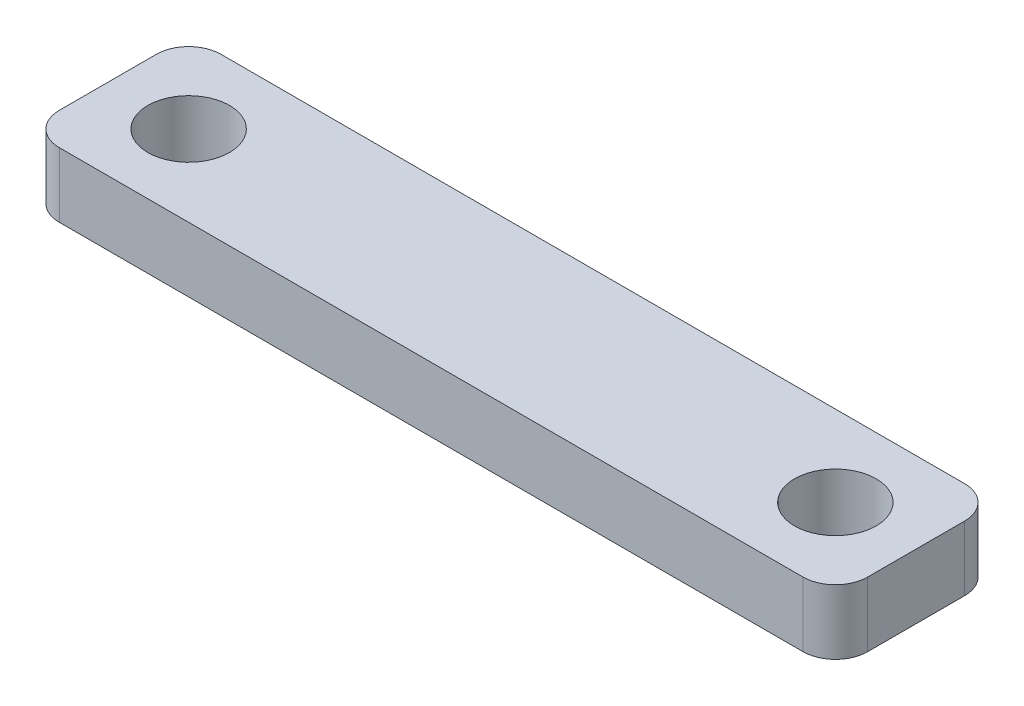
ISO-10303-21;
HEADER;
FILE_DESCRIPTION(('STEP AP214'),'2;1');
FILE_NAME('part.step','',(''),(''),'','','');
FILE_SCHEMA(('AUTOMOTIVE_DESIGN { 1 0 10303 214 1 1 1 1 }'));
ENDSEC;
DATA;
#1=APPLICATION_CONTEXT('core data for automotive mechanical design processes');
#2=APPLICATION_PROTOCOL_DEFINITION('international standard','automotive_design',2000,#1);
#3=PRODUCT_CONTEXT('',#1,'mechanical');
#4=PRODUCT('Part','Part','',(#3));
#5=PRODUCT_RELATED_PRODUCT_CATEGORY('part','',(#4));
#6=PRODUCT_DEFINITION_FORMATION('','',#4);
#7=PRODUCT_DEFINITION_CONTEXT('part definition',#1,'design');
#8=PRODUCT_DEFINITION('design','',#6,#7);
#9=PRODUCT_DEFINITION_SHAPE('','',#8);
#10=(LENGTH_UNIT() NAMED_UNIT(*) SI_UNIT(.MILLI.,.METRE.));
#11=(NAMED_UNIT(*) PLANE_ANGLE_UNIT() SI_UNIT($,.RADIAN.));
#12=(NAMED_UNIT(*) SI_UNIT($,.STERADIAN.) SOLID_ANGLE_UNIT());
#13=UNCERTAINTY_MEASURE_WITH_UNIT(LENGTH_MEASURE(1.E-05),#10,'distance_accuracy_value','');
#14=(GEOMETRIC_REPRESENTATION_CONTEXT(3) GLOBAL_UNCERTAINTY_ASSIGNED_CONTEXT((#13)) GLOBAL_UNIT_ASSIGNED_CONTEXT((#10,
#11,#12)) REPRESENTATION_CONTEXT('',''));
#15=CARTESIAN_POINT('',(0.,0.,0.));
#16=DIRECTION('',(0.,0.,1.));
#17=DIRECTION('',(1.,0.,0.));
#18=AXIS2_PLACEMENT_3D('',#15,#16,#17);
#19=CARTESIAN_POINT('',(0.,4.,0.));
#20=DIRECTION('',(0.,-1.,0.));
#21=DIRECTION('',(0.,0.,-1.));
#22=AXIS2_PLACEMENT_3D('',#19,#20,#21);
#23=PLANE('',#22);
#24=DIRECTION('',(0.,0.,-1.));
#25=VECTOR('',#24,1.);
#26=CARTESIAN_POINT('',(5.,4.,5.));
#27=LINE('',#26,#25);
#28=CARTESIAN_POINT('',(5.,4.,3.));
#29=VERTEX_POINT('',#28);
#30=CARTESIAN_POINT('',(5.,4.,-3.));
#31=VERTEX_POINT('',#30);
#32=EDGE_CURVE('E173',#29,#31,#27,.T.);
#33=ORIENTED_EDGE('',*,*,#32,.T.);
#34=CARTESIAN_POINT('',(3.,4.,-3.));
#35=DIRECTION('',(0.,-1.,0.));
#36=DIRECTION('',(0.,0.,-1.));
#37=AXIS2_PLACEMENT_3D('',#34,#35,#36);
#38=CIRCLE('',#37,2.);
#39=CARTESIAN_POINT('',(2.99999999999999,4.,-5.));
#40=VERTEX_POINT('',#39);
#41=EDGE_CURVE('E150',#31,#40,#38,.F.);
#42=ORIENTED_EDGE('',*,*,#41,.T.);
#43=DIRECTION('',(-1.,0.,0.));
#44=VECTOR('',#43,1.);
#45=CARTESIAN_POINT('',(-45.,4.,-5.));
#46=LINE('',#45,#44);
#47=CARTESIAN_POINT('',(-43.,4.,-5.));
#48=VERTEX_POINT('',#47);
#49=EDGE_CURVE('E121',#40,#48,#46,.T.);
#50=ORIENTED_EDGE('',*,*,#49,.T.);
#51=CARTESIAN_POINT('',(-43.,4.,-3.));
#52=DIRECTION('',(0.,-1.,0.));
#53=DIRECTION('',(0.,0.,-1.));
#54=AXIS2_PLACEMENT_3D('',#51,#52,#53);
#55=CIRCLE('',#54,2.);
#56=CARTESIAN_POINT('',(-45.,4.,-3.));
#57=VERTEX_POINT('',#56);
#58=EDGE_CURVE('E145',#48,#57,#55,.F.);
#59=ORIENTED_EDGE('',*,*,#58,.T.);
#60=DIRECTION('',(0.,0.,1.));
#61=VECTOR('',#60,1.);
#62=CARTESIAN_POINT('',(-45.,4.,5.));
#63=LINE('',#62,#61);
#64=CARTESIAN_POINT('',(-45.,4.,3.));
#65=VERTEX_POINT('',#64);
#66=EDGE_CURVE('E128',#57,#65,#63,.T.);
#67=ORIENTED_EDGE('',*,*,#66,.T.);
#68=CARTESIAN_POINT('',(-43.,4.,3.));
#69=DIRECTION('',(0.,-1.,0.));
#70=DIRECTION('',(0.,0.,-1.));
#71=AXIS2_PLACEMENT_3D('',#68,#69,#70);
#72=CIRCLE('',#71,2.);
#73=CARTESIAN_POINT('',(-43.,4.,5.));
#74=VERTEX_POINT('',#73);
#75=EDGE_CURVE('E57',#65,#74,#72,.F.);
#76=ORIENTED_EDGE('',*,*,#75,.T.);
#77=DIRECTION('',(1.,0.,0.));
#78=VECTOR('',#77,1.);
#79=CARTESIAN_POINT('',(-45.,4.,5.));
#80=LINE('',#79,#78);
#81=CARTESIAN_POINT('',(2.99999999999999,4.,5.));
#82=VERTEX_POINT('',#81);
#83=EDGE_CURVE('E131',#74,#82,#80,.T.);
#84=ORIENTED_EDGE('',*,*,#83,.T.);
#85=CARTESIAN_POINT('',(3.,4.,3.));
#86=DIRECTION('',(0.,-1.,0.));
#87=DIRECTION('',(0.,0.,-1.));
#88=AXIS2_PLACEMENT_3D('',#85,#86,#87);
#89=CIRCLE('',#88,2.);
#90=EDGE_CURVE('E148',#82,#29,#89,.F.);
#91=ORIENTED_EDGE('',*,*,#90,.T.);
#92=EDGE_LOOP('',(#33,#42,#50,#59,#67,#76,#84,#91));
#93=FACE_BOUND('',#92,.T.);
#94=CARTESIAN_POINT('',(0.,4.,0.));
#95=DIRECTION('',(0.,1.,0.));
#96=DIRECTION('',(0.,0.,1.));
#97=AXIS2_PLACEMENT_3D('',#94,#95,#96);
#98=CIRCLE('',#97,2.525);
#99=CARTESIAN_POINT('',(0.,4.,2.525));
#100=VERTEX_POINT('',#99);
#101=EDGE_CURVE('E166',#100,#100,#98,.T.);
#102=ORIENTED_EDGE('',*,*,#101,.F.);
#103=EDGE_LOOP('',(#102));
#104=FACE_BOUND('',#103,.T.);
#105=CARTESIAN_POINT('',(-40.,4.,0.));
#106=DIRECTION('',(0.,1.,0.));
#107=DIRECTION('',(0.,0.,1.));
#108=AXIS2_PLACEMENT_3D('',#105,#106,#107);
#109=CIRCLE('',#108,2.525);
#110=CARTESIAN_POINT('',(-40.,4.,2.525));
#111=VERTEX_POINT('',#110);
#112=EDGE_CURVE('E178',#111,#111,#109,.T.);
#113=ORIENTED_EDGE('',*,*,#112,.F.);
#114=EDGE_LOOP('',(#113));
#115=FACE_BOUND('',#114,.T.);
#116=ADVANCED_FACE('F35',(#93,#104,#115),#23,.F.);
#117=CARTESIAN_POINT('',(0.,0.,0.));
#118=DIRECTION('',(0.,-1.,0.));
#119=DIRECTION('',(0.,0.,-1.));
#120=AXIS2_PLACEMENT_3D('',#117,#118,#119);
#121=PLANE('',#120);
#122=CARTESIAN_POINT('',(0.,0.,0.));
#123=DIRECTION('',(0.,1.,0.));
#124=DIRECTION('',(0.,0.,1.));
#125=AXIS2_PLACEMENT_3D('',#122,#123,#124);
#126=CIRCLE('',#125,2.525);
#127=CARTESIAN_POINT('',(0.,0.,2.525));
#128=VERTEX_POINT('',#127);
#129=EDGE_CURVE('E169',#128,#128,#126,.T.);
#130=ORIENTED_EDGE('',*,*,#129,.T.);
#131=EDGE_LOOP('',(#130));
#132=FACE_BOUND('',#131,.T.);
#133=DIRECTION('',(-1.,0.,0.));
#134=VECTOR('',#133,1.);
#135=CARTESIAN_POINT('',(-45.,0.,-5.));
#136=LINE('',#135,#134);
#137=CARTESIAN_POINT('',(2.99999999999999,0.,-5.));
#138=VERTEX_POINT('',#137);
#139=CARTESIAN_POINT('',(-43.,0.,-5.));
#140=VERTEX_POINT('',#139);
#141=EDGE_CURVE('E118',#138,#140,#136,.T.);
#142=ORIENTED_EDGE('',*,*,#141,.F.);
#143=CARTESIAN_POINT('',(3.,0.,-3.));
#144=DIRECTION('',(0.,-1.,0.));
#145=DIRECTION('',(0.,0.,-1.));
#146=AXIS2_PLACEMENT_3D('',#143,#144,#145);
#147=CIRCLE('',#146,2.);
#148=CARTESIAN_POINT('',(5.,0.,-3.));
#149=VERTEX_POINT('',#148);
#150=EDGE_CURVE('E101',#138,#149,#147,.T.);
#151=ORIENTED_EDGE('',*,*,#150,.T.);
#152=DIRECTION('',(0.,0.,-1.));
#153=VECTOR('',#152,1.);
#154=CARTESIAN_POINT('',(5.,0.,5.));
#155=LINE('',#154,#153);
#156=CARTESIAN_POINT('',(5.,0.,3.));
#157=VERTEX_POINT('',#156);
#158=EDGE_CURVE('E129',#157,#149,#155,.T.);
#159=ORIENTED_EDGE('',*,*,#158,.F.);
#160=CARTESIAN_POINT('',(3.,0.,3.));
#161=DIRECTION('',(0.,-1.,0.));
#162=DIRECTION('',(0.,0.,-1.));
#163=AXIS2_PLACEMENT_3D('',#160,#161,#162);
#164=CIRCLE('',#163,2.);
#165=CARTESIAN_POINT('',(2.99999999999999,0.,5.));
#166=VERTEX_POINT('',#165);
#167=EDGE_CURVE('E112',#157,#166,#164,.T.);
#168=ORIENTED_EDGE('',*,*,#167,.T.);
#169=DIRECTION('',(1.,0.,0.));
#170=VECTOR('',#169,1.);
#171=CARTESIAN_POINT('',(-45.,0.,5.));
#172=LINE('',#171,#170);
#173=CARTESIAN_POINT('',(-43.,0.,5.));
#174=VERTEX_POINT('',#173);
#175=EDGE_CURVE('E133',#174,#166,#172,.T.);
#176=ORIENTED_EDGE('',*,*,#175,.F.);
#177=CARTESIAN_POINT('',(-43.,0.,3.));
#178=DIRECTION('',(0.,-1.,0.));
#179=DIRECTION('',(0.,0.,-1.));
#180=AXIS2_PLACEMENT_3D('',#177,#178,#179);
#181=CIRCLE('',#180,2.);
#182=CARTESIAN_POINT('',(-45.,0.,3.));
#183=VERTEX_POINT('',#182);
#184=EDGE_CURVE('E139',#174,#183,#181,.T.);
#185=ORIENTED_EDGE('',*,*,#184,.T.);
#186=DIRECTION('',(0.,0.,1.));
#187=VECTOR('',#186,1.);
#188=CARTESIAN_POINT('',(-45.,0.,5.));
#189=LINE('',#188,#187);
#190=CARTESIAN_POINT('',(-45.,0.,-3.));
#191=VERTEX_POINT('',#190);
#192=EDGE_CURVE('E161',#191,#183,#189,.T.);
#193=ORIENTED_EDGE('',*,*,#192,.F.);
#194=CARTESIAN_POINT('',(-43.,0.,-3.));
#195=DIRECTION('',(0.,-1.,0.));
#196=DIRECTION('',(0.,0.,-1.));
#197=AXIS2_PLACEMENT_3D('',#194,#195,#196);
#198=CIRCLE('',#197,2.);
#199=EDGE_CURVE('E122',#191,#140,#198,.T.);
#200=ORIENTED_EDGE('',*,*,#199,.T.);
#201=EDGE_LOOP('',(#142,#151,#159,#168,#176,#185,#193,#200));
#202=FACE_BOUND('',#201,.T.);
#203=CARTESIAN_POINT('',(-40.,0.,0.));
#204=DIRECTION('',(0.,1.,0.));
#205=DIRECTION('',(0.,0.,1.));
#206=AXIS2_PLACEMENT_3D('',#203,#204,#205);
#207=CIRCLE('',#206,2.525);
#208=CARTESIAN_POINT('',(-40.,0.,2.525));
#209=VERTEX_POINT('',#208);
#210=EDGE_CURVE('E180',#209,#209,#207,.T.);
#211=ORIENTED_EDGE('',*,*,#210,.T.);
#212=EDGE_LOOP('',(#211));
#213=FACE_BOUND('',#212,.T.);
#214=ADVANCED_FACE('F125',(#132,#202,#213),#121,.T.);
#215=CARTESIAN_POINT('',(-45.,4.,5.));
#216=DIRECTION('',(1.,0.,0.));
#217=DIRECTION('',(0.,0.,-1.));
#218=AXIS2_PLACEMENT_3D('',#215,#216,#217);
#219=PLANE('',#218);
#220=ORIENTED_EDGE('',*,*,#192,.T.);
#221=DIRECTION('',(0.,-1.,0.));
#222=VECTOR('',#221,1.);
#223=CARTESIAN_POINT('',(-45.,4.,3.));
#224=LINE('',#223,#222);
#225=EDGE_CURVE('E11',#183,#65,#224,.F.);
#226=ORIENTED_EDGE('',*,*,#225,.T.);
#227=ORIENTED_EDGE('',*,*,#66,.F.);
#228=DIRECTION('',(0.,-1.,0.));
#229=VECTOR('',#228,1.);
#230=CARTESIAN_POINT('',(-45.,4.,-3.));
#231=LINE('',#230,#229);
#232=EDGE_CURVE('E43',#57,#191,#231,.T.);
#233=ORIENTED_EDGE('',*,*,#232,.T.);
#234=EDGE_LOOP('',(#220,#226,#227,#233));
#235=FACE_BOUND('',#234,.T.);
#236=ADVANCED_FACE('F160',(#235),#219,.F.);
#237=CARTESIAN_POINT('',(-45.,4.,5.));
#238=DIRECTION('',(0.,0.,-1.));
#239=DIRECTION('',(-1.,0.,0.));
#240=AXIS2_PLACEMENT_3D('',#237,#238,#239);
#241=PLANE('',#240);
#242=ORIENTED_EDGE('',*,*,#175,.T.);
#243=DIRECTION('',(0.,-1.,0.));
#244=VECTOR('',#243,1.);
#245=CARTESIAN_POINT('',(3.,4.,5.));
#246=LINE('',#245,#244);
#247=EDGE_CURVE('E50',#166,#82,#246,.F.);
#248=ORIENTED_EDGE('',*,*,#247,.T.);
#249=ORIENTED_EDGE('',*,*,#83,.F.);
#250=DIRECTION('',(0.,-1.,0.));
#251=VECTOR('',#250,1.);
#252=CARTESIAN_POINT('',(-43.,4.,5.));
#253=LINE('',#252,#251);
#254=EDGE_CURVE('E152',#74,#174,#253,.T.);
#255=ORIENTED_EDGE('',*,*,#254,.T.);
#256=EDGE_LOOP('',(#242,#248,#249,#255));
#257=FACE_BOUND('',#256,.T.);
#258=ADVANCED_FACE('F206',(#257),#241,.F.);
#259=CARTESIAN_POINT('',(5.,4.,5.));
#260=DIRECTION('',(-1.,0.,0.));
#261=DIRECTION('',(0.,0.,1.));
#262=AXIS2_PLACEMENT_3D('',#259,#260,#261);
#263=PLANE('',#262);
#264=ORIENTED_EDGE('',*,*,#158,.T.);
#265=DIRECTION('',(0.,-1.,0.));
#266=VECTOR('',#265,1.);
#267=CARTESIAN_POINT('',(5.,4.,-3.));
#268=LINE('',#267,#266);
#269=EDGE_CURVE('E106',#149,#31,#268,.F.);
#270=ORIENTED_EDGE('',*,*,#269,.T.);
#271=ORIENTED_EDGE('',*,*,#32,.F.);
#272=DIRECTION('',(0.,-1.,0.));
#273=VECTOR('',#272,1.);
#274=CARTESIAN_POINT('',(5.,4.,3.));
#275=LINE('',#274,#273);
#276=EDGE_CURVE('E111',#29,#157,#275,.T.);
#277=ORIENTED_EDGE('',*,*,#276,.T.);
#278=EDGE_LOOP('',(#264,#270,#271,#277));
#279=FACE_BOUND('',#278,.T.);
#280=ADVANCED_FACE('F203',(#279),#263,.F.);
#281=CARTESIAN_POINT('',(-45.,4.,-5.));
#282=DIRECTION('',(0.,0.,1.));
#283=DIRECTION('',(1.,0.,0.));
#284=AXIS2_PLACEMENT_3D('',#281,#282,#283);
#285=PLANE('',#284);
#286=ORIENTED_EDGE('',*,*,#49,.F.);
#287=DIRECTION('',(0.,-1.,0.));
#288=VECTOR('',#287,1.);
#289=CARTESIAN_POINT('',(3.,4.,-5.));
#290=LINE('',#289,#288);
#291=EDGE_CURVE('E105',#40,#138,#290,.T.);
#292=ORIENTED_EDGE('',*,*,#291,.T.);
#293=ORIENTED_EDGE('',*,*,#141,.T.);
#294=DIRECTION('',(0.,-1.,0.));
#295=VECTOR('',#294,1.);
#296=CARTESIAN_POINT('',(-43.,4.,-5.));
#297=LINE('',#296,#295);
#298=EDGE_CURVE('E123',#140,#48,#297,.F.);
#299=ORIENTED_EDGE('',*,*,#298,.T.);
#300=EDGE_LOOP('',(#286,#292,#293,#299));
#301=FACE_BOUND('',#300,.T.);
#302=ADVANCED_FACE('F117',(#301),#285,.F.);
#303=CARTESIAN_POINT('',(0.,4.,0.));
#304=DIRECTION('',(0.,-1.,0.));
#305=DIRECTION('',(0.,0.,-1.));
#306=AXIS2_PLACEMENT_3D('',#303,#304,#305);
#307=CYLINDRICAL_SURFACE('',#306,2.525);
#308=ORIENTED_EDGE('',*,*,#101,.T.);
#309=EDGE_LOOP('',(#308));
#310=FACE_BOUND('',#309,.T.);
#311=ORIENTED_EDGE('',*,*,#129,.F.);
#312=EDGE_LOOP('',(#311));
#313=FACE_BOUND('',#312,.T.);
#314=ADVANCED_FACE('F198',(#310,#313),#307,.F.);
#315=CARTESIAN_POINT('',(-40.,4.,0.));
#316=DIRECTION('',(0.,-1.,0.));
#317=DIRECTION('',(0.,0.,-1.));
#318=AXIS2_PLACEMENT_3D('',#315,#316,#317);
#319=CYLINDRICAL_SURFACE('',#318,2.525);
#320=ORIENTED_EDGE('',*,*,#112,.T.);
#321=EDGE_LOOP('',(#320));
#322=FACE_BOUND('',#321,.T.);
#323=ORIENTED_EDGE('',*,*,#210,.F.);
#324=EDGE_LOOP('',(#323));
#325=FACE_BOUND('',#324,.T.);
#326=ADVANCED_FACE('F186',(#322,#325),#319,.F.);
#327=CARTESIAN_POINT('',(3.,4.,-3.));
#328=DIRECTION('',(0.,-1.,0.));
#329=DIRECTION('',(0.,0.,-1.));
#330=AXIS2_PLACEMENT_3D('',#327,#328,#329);
#331=CYLINDRICAL_SURFACE('',#330,2.);
#332=ORIENTED_EDGE('',*,*,#41,.F.);
#333=ORIENTED_EDGE('',*,*,#269,.F.);
#334=ORIENTED_EDGE('',*,*,#150,.F.);
#335=ORIENTED_EDGE('',*,*,#291,.F.);
#336=EDGE_LOOP('',(#332,#333,#334,#335));
#337=FACE_BOUND('',#336,.T.);
#338=ADVANCED_FACE('F104',(#337),#331,.T.);
#339=CARTESIAN_POINT('',(3.,4.,3.));
#340=DIRECTION('',(0.,-1.,0.));
#341=DIRECTION('',(0.,0.,-1.));
#342=AXIS2_PLACEMENT_3D('',#339,#340,#341);
#343=CYLINDRICAL_SURFACE('',#342,2.);
#344=ORIENTED_EDGE('',*,*,#90,.F.);
#345=ORIENTED_EDGE('',*,*,#247,.F.);
#346=ORIENTED_EDGE('',*,*,#167,.F.);
#347=ORIENTED_EDGE('',*,*,#276,.F.);
#348=EDGE_LOOP('',(#344,#345,#346,#347));
#349=FACE_BOUND('',#348,.T.);
#350=ADVANCED_FACE('F214',(#349),#343,.T.);
#351=CARTESIAN_POINT('',(-43.,4.,3.));
#352=DIRECTION('',(0.,-1.,0.));
#353=DIRECTION('',(0.,0.,-1.));
#354=AXIS2_PLACEMENT_3D('',#351,#352,#353);
#355=CYLINDRICAL_SURFACE('',#354,2.);
#356=ORIENTED_EDGE('',*,*,#75,.F.);
#357=ORIENTED_EDGE('',*,*,#225,.F.);
#358=ORIENTED_EDGE('',*,*,#184,.F.);
#359=ORIENTED_EDGE('',*,*,#254,.F.);
#360=EDGE_LOOP('',(#356,#357,#358,#359));
#361=FACE_BOUND('',#360,.T.);
#362=ADVANCED_FACE('F216',(#361),#355,.T.);
#363=CARTESIAN_POINT('',(-43.,4.,-3.));
#364=DIRECTION('',(0.,-1.,0.));
#365=DIRECTION('',(0.,0.,-1.));
#366=AXIS2_PLACEMENT_3D('',#363,#364,#365);
#367=CYLINDRICAL_SURFACE('',#366,2.);
#368=ORIENTED_EDGE('',*,*,#58,.F.);
#369=ORIENTED_EDGE('',*,*,#298,.F.);
#370=ORIENTED_EDGE('',*,*,#199,.F.);
#371=ORIENTED_EDGE('',*,*,#232,.F.);
#372=EDGE_LOOP('',(#368,#369,#370,#371));
#373=FACE_BOUND('',#372,.T.);
#374=ADVANCED_FACE('F37',(#373),#367,.T.);
#375=CLOSED_SHELL('',(#116,#214,#236,#258,#280,#302,#314,#326,#338,#350,#362,#374));
#376=MANIFOLD_SOLID_BREP('B2',#375);
#377=ADVANCED_BREP_SHAPE_REPRESENTATION('',(#18,#376),#14);
#378=SHAPE_DEFINITION_REPRESENTATION(#9,#377);
ENDSEC;
END-ISO-10303-21;
